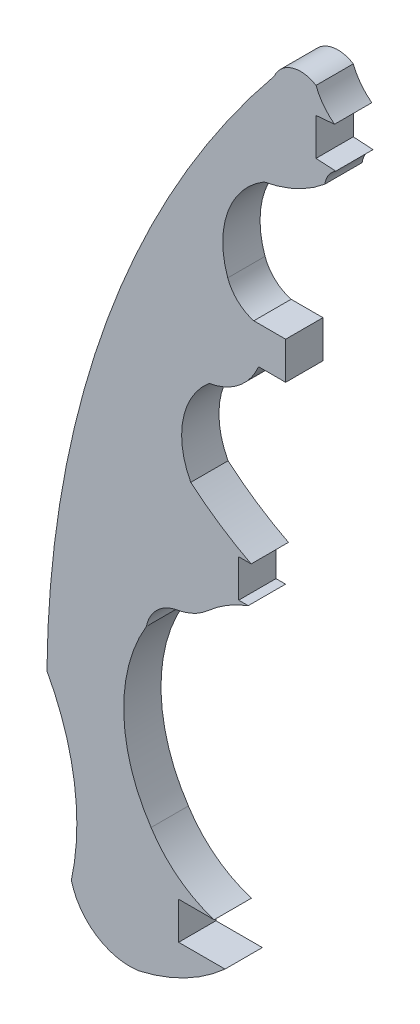
ISO-10303-21;
HEADER;
FILE_DESCRIPTION(('STEP AP214'),'2;1');
FILE_NAME('part.step','',(''),(''),'','','');
FILE_SCHEMA(('AUTOMOTIVE_DESIGN { 1 0 10303 214 1 1 1 1 }'));
ENDSEC;
DATA;
#1=APPLICATION_CONTEXT('core data for automotive mechanical design processes');
#2=APPLICATION_PROTOCOL_DEFINITION('international standard','automotive_design',2000,#1);
#3=PRODUCT_CONTEXT('',#1,'mechanical');
#4=PRODUCT('Part','Part','',(#3));
#5=PRODUCT_RELATED_PRODUCT_CATEGORY('part','',(#4));
#6=PRODUCT_DEFINITION_FORMATION('','',#4);
#7=PRODUCT_DEFINITION_CONTEXT('part definition',#1,'design');
#8=PRODUCT_DEFINITION('design','',#6,#7);
#9=PRODUCT_DEFINITION_SHAPE('','',#8);
#10=(LENGTH_UNIT() NAMED_UNIT(*) SI_UNIT(.MILLI.,.METRE.));
#11=(NAMED_UNIT(*) PLANE_ANGLE_UNIT() SI_UNIT($,.RADIAN.));
#12=(NAMED_UNIT(*) SI_UNIT($,.STERADIAN.) SOLID_ANGLE_UNIT());
#13=UNCERTAINTY_MEASURE_WITH_UNIT(LENGTH_MEASURE(1.E-05),#10,'distance_accuracy_value','');
#14=(GEOMETRIC_REPRESENTATION_CONTEXT(3) GLOBAL_UNCERTAINTY_ASSIGNED_CONTEXT((#13)) GLOBAL_UNIT_ASSIGNED_CONTEXT((#10,
#11,#12)) REPRESENTATION_CONTEXT('',''));
#15=CARTESIAN_POINT('',(0.,0.,0.));
#16=DIRECTION('',(0.,0.,1.));
#17=DIRECTION('',(1.,0.,0.));
#18=AXIS2_PLACEMENT_3D('',#15,#16,#17);
#19=CARTESIAN_POINT('',(0.,13.3480948875047,1.524));
#20=DIRECTION('',(0.,1.,0.));
#21=DIRECTION('',(0.,0.,1.));
#22=AXIS2_PLACEMENT_3D('',#19,#20,#21);
#23=PLANE('',#22);
#24=DIRECTION('',(1.,0.,0.));
#25=VECTOR('',#24,1.);
#26=CARTESIAN_POINT('',(0.,13.3480948875047,0.));
#27=LINE('',#26,#25);
#28=CARTESIAN_POINT('',(-108.369232510626,13.3480948875047,0.));
#29=VERTEX_POINT('',#28);
#30=CARTESIAN_POINT('',(-107.861232510626,13.3480948875047,0.));
#31=VERTEX_POINT('',#30);
#32=EDGE_CURVE('E262',#29,#31,#27,.T.);
#33=ORIENTED_EDGE('',*,*,#32,.T.);
#34=DIRECTION('',(0.,0.,-1.));
#35=VECTOR('',#34,1.);
#36=CARTESIAN_POINT('',(-107.861232510626,13.3480948875047,1.524));
#37=LINE('',#36,#35);
#38=CARTESIAN_POINT('',(-107.861232510626,13.3480948875047,1.524));
#39=VERTEX_POINT('',#38);
#40=EDGE_CURVE('E11',#39,#31,#37,.T.);
#41=ORIENTED_EDGE('',*,*,#40,.F.);
#42=DIRECTION('',(1.,0.,0.));
#43=VECTOR('',#42,1.);
#44=CARTESIAN_POINT('',(0.,13.3480948875047,1.524));
#45=LINE('',#44,#43);
#46=CARTESIAN_POINT('',(-108.369232510626,13.3480948875047,1.524));
#47=VERTEX_POINT('',#46);
#48=EDGE_CURVE('E345',#47,#39,#45,.T.);
#49=ORIENTED_EDGE('',*,*,#48,.F.);
#50=DIRECTION('',(0.,0.,-1.));
#51=VECTOR('',#50,1.);
#52=CARTESIAN_POINT('',(-108.369232510626,13.3480948875047,1.524));
#53=LINE('',#52,#51);
#54=EDGE_CURVE('E49',#47,#29,#53,.T.);
#55=ORIENTED_EDGE('',*,*,#54,.T.);
#56=EDGE_LOOP('',(#33,#41,#49,#55));
#57=FACE_BOUND('',#56,.T.);
#58=ADVANCED_FACE('F33',(#57),#23,.F.);
#59=CARTESIAN_POINT('',(-101.918086266978,24.886807908126,1.524));
#60=DIRECTION('',(0.,0.,-1.));
#61=DIRECTION('',(-1.,0.,0.));
#62=AXIS2_PLACEMENT_3D('',#59,#60,#61);
#63=CYLINDRICAL_SURFACE('',#62,12.9793253077979);
#64=CARTESIAN_POINT('',(-101.918086266978,24.886807908126,0.));
#65=DIRECTION('',(0.,0.,1.));
#66=DIRECTION('',(1.,0.,0.));
#67=AXIS2_PLACEMENT_3D('',#64,#65,#66);
#68=CIRCLE('',#67,12.9793253077979);
#69=CARTESIAN_POINT('',(-110.328866366672,15.0013810807081,0.));
#70=VERTEX_POINT('',#69);
#71=EDGE_CURVE('E264',#31,#70,#68,.F.);
#72=ORIENTED_EDGE('',*,*,#71,.T.);
#73=DIRECTION('',(0.,0.,-1.));
#74=VECTOR('',#73,1.);
#75=CARTESIAN_POINT('',(-110.328866366672,15.0013810807081,1.524));
#76=LINE('',#75,#74);
#77=CARTESIAN_POINT('',(-110.328866366672,15.0013810807081,1.524));
#78=VERTEX_POINT('',#77);
#79=EDGE_CURVE('E41',#78,#70,#76,.T.);
#80=ORIENTED_EDGE('',*,*,#79,.F.);
#81=CARTESIAN_POINT('',(-101.918086266978,24.886807908126,1.524));
#82=DIRECTION('',(0.,0.,1.));
#83=DIRECTION('',(1.,0.,0.));
#84=AXIS2_PLACEMENT_3D('',#81,#82,#83);
#85=CIRCLE('',#84,12.9793253077979);
#86=EDGE_CURVE('E153',#39,#78,#85,.F.);
#87=ORIENTED_EDGE('',*,*,#86,.F.);
#88=ORIENTED_EDGE('',*,*,#40,.T.);
#89=EDGE_LOOP('',(#72,#80,#87,#88));
#90=FACE_BOUND('',#89,.T.);
#91=ADVANCED_FACE('F405',(#90),#63,.F.);
#92=CARTESIAN_POINT('',(-107.580688720072,16.4812326560787,1.524));
#93=DIRECTION('',(0.,0.,-1.));
#94=DIRECTION('',(-1.,0.,0.));
#95=AXIS2_PLACEMENT_3D('',#92,#93,#94);
#96=CYLINDRICAL_SURFACE('',#95,3.12128836578655);
#97=CARTESIAN_POINT('',(-107.580688720072,16.4812326560787,0.));
#98=DIRECTION('',(0.,0.,1.));
#99=DIRECTION('',(1.,0.,0.));
#100=AXIS2_PLACEMENT_3D('',#97,#98,#99);
#101=CIRCLE('',#100,3.12128836578655);
#102=CARTESIAN_POINT('',(-109.57918557092,18.878825490475,0.));
#103=VERTEX_POINT('',#102);
#104=EDGE_CURVE('E267',#103,#70,#101,.T.);
#105=ORIENTED_EDGE('',*,*,#104,.F.);
#106=DIRECTION('',(0.,0.,-1.));
#107=VECTOR('',#106,1.);
#108=CARTESIAN_POINT('',(-109.57918557092,18.878825490475,1.524));
#109=LINE('',#108,#107);
#110=CARTESIAN_POINT('',(-109.57918557092,18.878825490475,1.524));
#111=VERTEX_POINT('',#110);
#112=EDGE_CURVE('E398',#111,#103,#109,.T.);
#113=ORIENTED_EDGE('',*,*,#112,.F.);
#114=CARTESIAN_POINT('',(-107.580688720072,16.4812326560787,1.524));
#115=DIRECTION('',(0.,0.,1.));
#116=DIRECTION('',(1.,0.,0.));
#117=AXIS2_PLACEMENT_3D('',#114,#115,#116);
#118=CIRCLE('',#117,3.12128836578655);
#119=EDGE_CURVE('E404',#111,#78,#118,.T.);
#120=ORIENTED_EDGE('',*,*,#119,.T.);
#121=ORIENTED_EDGE('',*,*,#79,.T.);
#122=EDGE_LOOP('',(#105,#113,#120,#121));
#123=FACE_BOUND('',#122,.T.);
#124=ADVANCED_FACE('F402',(#123),#96,.F.);
#125=CARTESIAN_POINT('',(-110.027978736607,21.5229388257653,1.524));
#126=DIRECTION('',(0.,0.,-1.));
#127=DIRECTION('',(-1.,0.,0.));
#128=AXIS2_PLACEMENT_3D('',#125,#126,#127);
#129=CYLINDRICAL_SURFACE('',#128,2.68193039347167);
#130=CARTESIAN_POINT('',(-110.027978736607,21.5229388257653,0.));
#131=DIRECTION('',(0.,0.,1.));
#132=DIRECTION('',(1.,0.,0.));
#133=AXIS2_PLACEMENT_3D('',#130,#131,#132);
#134=CIRCLE('',#133,2.68193039347167);
#135=CARTESIAN_POINT('',(-107.557691457711,20.4787015945033,0.));
#136=VERTEX_POINT('',#135);
#137=EDGE_CURVE('E270',#136,#103,#134,.F.);
#138=ORIENTED_EDGE('',*,*,#137,.F.);
#139=DIRECTION('',(0.,0.,-1.));
#140=VECTOR('',#139,1.);
#141=CARTESIAN_POINT('',(-107.557691457711,20.4787015945033,1.524));
#142=LINE('',#141,#140);
#143=CARTESIAN_POINT('',(-107.557691457711,20.4787015945033,1.524));
#144=VERTEX_POINT('',#143);
#145=EDGE_CURVE('E396',#144,#136,#142,.T.);
#146=ORIENTED_EDGE('',*,*,#145,.F.);
#147=CARTESIAN_POINT('',(-110.027978736607,21.5229388257653,1.524));
#148=DIRECTION('',(0.,0.,1.));
#149=DIRECTION('',(1.,0.,0.));
#150=AXIS2_PLACEMENT_3D('',#147,#148,#149);
#151=CIRCLE('',#150,2.68193039347167);
#152=EDGE_CURVE('E415',#144,#111,#151,.F.);
#153=ORIENTED_EDGE('',*,*,#152,.T.);
#154=ORIENTED_EDGE('',*,*,#112,.T.);
#155=EDGE_LOOP('',(#138,#146,#153,#154));
#156=FACE_BOUND('',#155,.T.);
#157=ADVANCED_FACE('F412',(#156),#129,.T.);
#158=CARTESIAN_POINT('',(0.,20.4787015945033,1.524));
#159=DIRECTION('',(0.,-1.,0.));
#160=DIRECTION('',(0.,0.,-1.));
#161=AXIS2_PLACEMENT_3D('',#158,#159,#160);
#162=PLANE('',#161);
#163=DIRECTION('',(-1.,0.,0.));
#164=VECTOR('',#163,1.);
#165=CARTESIAN_POINT('',(0.,20.4787015945033,0.));
#166=LINE('',#165,#164);
#167=CARTESIAN_POINT('',(-106.451038150922,20.4787015945033,0.));
#168=VERTEX_POINT('',#167);
#169=EDGE_CURVE('E273',#168,#136,#166,.T.);
#170=ORIENTED_EDGE('',*,*,#169,.F.);
#171=DIRECTION('',(0.,0.,-1.));
#172=VECTOR('',#171,1.);
#173=CARTESIAN_POINT('',(-106.451038150922,20.4787015945033,1.524));
#174=LINE('',#173,#172);
#175=CARTESIAN_POINT('',(-106.451038150922,20.4787015945033,1.524));
#176=VERTEX_POINT('',#175);
#177=EDGE_CURVE('E394',#176,#168,#174,.T.);
#178=ORIENTED_EDGE('',*,*,#177,.F.);
#179=DIRECTION('',(-1.,0.,0.));
#180=VECTOR('',#179,1.);
#181=CARTESIAN_POINT('',(0.,20.4787015945033,1.524));
#182=LINE('',#181,#180);
#183=EDGE_CURVE('E419',#176,#144,#182,.T.);
#184=ORIENTED_EDGE('',*,*,#183,.T.);
#185=ORIENTED_EDGE('',*,*,#145,.T.);
#186=EDGE_LOOP('',(#170,#178,#184,#185));
#187=FACE_BOUND('',#186,.T.);
#188=ADVANCED_FACE('F507',(#187),#162,.T.);
#189=CARTESIAN_POINT('',(-106.451038150922,0.,1.524));
#190=DIRECTION('',(1.,0.,0.));
#191=DIRECTION('',(0.,0.,-1.));
#192=AXIS2_PLACEMENT_3D('',#189,#190,#191);
#193=PLANE('',#192);
#194=DIRECTION('',(0.,-1.,0.));
#195=VECTOR('',#194,1.);
#196=CARTESIAN_POINT('',(-106.451038150922,0.,0.));
#197=LINE('',#196,#195);
#198=CARTESIAN_POINT('',(-106.451038150922,22.0063903598248,0.));
#199=VERTEX_POINT('',#198);
#200=EDGE_CURVE('E276',#199,#168,#197,.T.);
#201=ORIENTED_EDGE('',*,*,#200,.F.);
#202=DIRECTION('',(0.,0.,-1.));
#203=VECTOR('',#202,1.);
#204=CARTESIAN_POINT('',(-106.451038150922,22.0063903598248,1.524));
#205=LINE('',#204,#203);
#206=CARTESIAN_POINT('',(-106.451038150922,22.0063903598248,1.524));
#207=VERTEX_POINT('',#206);
#208=EDGE_CURVE('E392',#207,#199,#205,.T.);
#209=ORIENTED_EDGE('',*,*,#208,.F.);
#210=DIRECTION('',(0.,-1.,0.));
#211=VECTOR('',#210,1.);
#212=CARTESIAN_POINT('',(-106.451038150922,0.,1.524));
#213=LINE('',#212,#211);
#214=EDGE_CURVE('E425',#207,#176,#213,.T.);
#215=ORIENTED_EDGE('',*,*,#214,.T.);
#216=ORIENTED_EDGE('',*,*,#177,.T.);
#217=EDGE_LOOP('',(#201,#209,#215,#216));
#218=FACE_BOUND('',#217,.T.);
#219=ADVANCED_FACE('F510',(#218),#193,.T.);
#220=CARTESIAN_POINT('',(0.,22.0063903598248,1.524));
#221=DIRECTION('',(0.,-1.,0.));
#222=DIRECTION('',(0.,0.,-1.));
#223=AXIS2_PLACEMENT_3D('',#220,#221,#222);
#224=PLANE('',#223);
#225=DIRECTION('',(-1.,0.,0.));
#226=VECTOR('',#225,1.);
#227=CARTESIAN_POINT('',(0.,22.0063903598248,0.));
#228=LINE('',#227,#226);
#229=CARTESIAN_POINT('',(-107.752531071807,22.0063903598248,0.));
#230=VERTEX_POINT('',#229);
#231=EDGE_CURVE('E279',#199,#230,#228,.T.);
#232=ORIENTED_EDGE('',*,*,#231,.T.);
#233=DIRECTION('',(0.,0.,-1.));
#234=VECTOR('',#233,1.);
#235=CARTESIAN_POINT('',(-107.752531071807,22.0063903598248,1.524));
#236=LINE('',#235,#234);
#237=CARTESIAN_POINT('',(-107.752531071807,22.0063903598248,1.524));
#238=VERTEX_POINT('',#237);
#239=EDGE_CURVE('E389',#238,#230,#236,.T.);
#240=ORIENTED_EDGE('',*,*,#239,.F.);
#241=DIRECTION('',(-1.,0.,0.));
#242=VECTOR('',#241,1.);
#243=CARTESIAN_POINT('',(0.,22.0063903598248,1.524));
#244=LINE('',#243,#242);
#245=EDGE_CURVE('E428',#207,#238,#244,.T.);
#246=ORIENTED_EDGE('',*,*,#245,.F.);
#247=ORIENTED_EDGE('',*,*,#208,.T.);
#248=EDGE_LOOP('',(#232,#240,#246,#247));
#249=FACE_BOUND('',#248,.T.);
#250=ADVANCED_FACE('F514',(#249),#224,.F.);
#251=CARTESIAN_POINT('',(-107.333912624667,23.5262694653189,1.524));
#252=DIRECTION('',(0.,0.,-1.));
#253=DIRECTION('',(-1.,0.,0.));
#254=AXIS2_PLACEMENT_3D('',#251,#252,#253);
#255=CYLINDRICAL_SURFACE('',#254,1.57647515032854);
#256=CARTESIAN_POINT('',(-107.333912624667,23.5262694653189,0.));
#257=DIRECTION('',(0.,0.,1.));
#258=DIRECTION('',(1.,0.,0.));
#259=AXIS2_PLACEMENT_3D('',#256,#257,#258);
#260=CIRCLE('',#259,1.57647515032854);
#261=CARTESIAN_POINT('',(-108.817338403116,22.9926761188112,0.));
#262=VERTEX_POINT('',#261);
#263=EDGE_CURVE('E281',#230,#262,#260,.F.);
#264=ORIENTED_EDGE('',*,*,#263,.T.);
#265=DIRECTION('',(0.,0.,-1.));
#266=VECTOR('',#265,1.);
#267=CARTESIAN_POINT('',(-108.817338403116,22.9926761188112,1.524));
#268=LINE('',#267,#266);
#269=CARTESIAN_POINT('',(-108.817338403116,22.9926761188112,1.524));
#270=VERTEX_POINT('',#269);
#271=EDGE_CURVE('E386',#270,#262,#268,.T.);
#272=ORIENTED_EDGE('',*,*,#271,.F.);
#273=CARTESIAN_POINT('',(-107.333912624667,23.5262694653189,1.524));
#274=DIRECTION('',(0.,0.,1.));
#275=DIRECTION('',(1.,0.,0.));
#276=AXIS2_PLACEMENT_3D('',#273,#274,#275);
#277=CIRCLE('',#276,1.57647515032854);
#278=EDGE_CURVE('E430',#238,#270,#277,.F.);
#279=ORIENTED_EDGE('',*,*,#278,.F.);
#280=ORIENTED_EDGE('',*,*,#239,.T.);
#281=EDGE_LOOP('',(#264,#272,#279,#280));
#282=FACE_BOUND('',#281,.T.);
#283=ADVANCED_FACE('F518',(#282),#255,.F.);
#284=CARTESIAN_POINT('',(-105.565537038083,24.1623602363142,1.524));
#285=DIRECTION('',(0.,0.,-1.));
#286=DIRECTION('',(-1.,0.,0.));
#287=AXIS2_PLACEMENT_3D('',#284,#285,#286);
#288=CYLINDRICAL_SURFACE('',#287,3.45577387170587);
#289=CARTESIAN_POINT('',(-105.565537038083,24.1623602363142,0.));
#290=DIRECTION('',(0.,0.,1.));
#291=DIRECTION('',(1.,0.,0.));
#292=AXIS2_PLACEMENT_3D('',#289,#290,#291);
#293=CIRCLE('',#292,3.45577387170587);
#294=CARTESIAN_POINT('',(-107.333979521729,27.1313641491447,0.));
#295=VERTEX_POINT('',#294);
#296=EDGE_CURVE('E283',#262,#295,#293,.F.);
#297=ORIENTED_EDGE('',*,*,#296,.T.);
#298=DIRECTION('',(0.,0.,-1.));
#299=VECTOR('',#298,1.);
#300=CARTESIAN_POINT('',(-107.333979521729,27.1313641491447,1.524));
#301=LINE('',#300,#299);
#302=CARTESIAN_POINT('',(-107.333979521729,27.1313641491447,1.524));
#303=VERTEX_POINT('',#302);
#304=EDGE_CURVE('E384',#303,#295,#301,.T.);
#305=ORIENTED_EDGE('',*,*,#304,.F.);
#306=CARTESIAN_POINT('',(-105.565537038083,24.1623602363142,1.524));
#307=DIRECTION('',(0.,0.,1.));
#308=DIRECTION('',(1.,0.,0.));
#309=AXIS2_PLACEMENT_3D('',#306,#307,#308);
#310=CIRCLE('',#309,3.45577387170587);
#311=EDGE_CURVE('E432',#270,#303,#310,.F.);
#312=ORIENTED_EDGE('',*,*,#311,.F.);
#313=ORIENTED_EDGE('',*,*,#271,.T.);
#314=EDGE_LOOP('',(#297,#305,#312,#313));
#315=FACE_BOUND('',#314,.T.);
#316=ADVANCED_FACE('F522',(#315),#288,.F.);
#317=CARTESIAN_POINT('',(-108.280674511607,32.3944754546542,1.524));
#318=DIRECTION('',(0.,0.,-1.));
#319=DIRECTION('',(-1.,0.,0.));
#320=AXIS2_PLACEMENT_3D('',#317,#318,#319);
#321=CYLINDRICAL_SURFACE('',#320,5.34757627510278);
#322=CARTESIAN_POINT('',(-108.280674511607,32.3944754546542,0.));
#323=DIRECTION('',(0.,0.,1.));
#324=DIRECTION('',(1.,0.,0.));
#325=AXIS2_PLACEMENT_3D('',#322,#323,#324);
#326=CIRCLE('',#325,5.34757627510278);
#327=CARTESIAN_POINT('',(-104.849681876034,28.2926634705814,0.));
#328=VERTEX_POINT('',#327);
#329=EDGE_CURVE('E286',#328,#295,#326,.F.);
#330=ORIENTED_EDGE('',*,*,#329,.F.);
#331=DIRECTION('',(0.,0.,-1.));
#332=VECTOR('',#331,1.);
#333=CARTESIAN_POINT('',(-104.849681876034,28.2926634705814,1.524));
#334=LINE('',#333,#332);
#335=CARTESIAN_POINT('',(-104.849681876034,28.2926634705814,1.524));
#336=VERTEX_POINT('',#335);
#337=EDGE_CURVE('E382',#336,#328,#334,.T.);
#338=ORIENTED_EDGE('',*,*,#337,.F.);
#339=CARTESIAN_POINT('',(-108.280674511607,32.3944754546542,1.524));
#340=DIRECTION('',(0.,0.,1.));
#341=DIRECTION('',(1.,0.,0.));
#342=AXIS2_PLACEMENT_3D('',#339,#340,#341);
#343=CIRCLE('',#342,5.34757627510278);
#344=EDGE_CURVE('E434',#336,#303,#343,.F.);
#345=ORIENTED_EDGE('',*,*,#344,.T.);
#346=ORIENTED_EDGE('',*,*,#304,.T.);
#347=EDGE_LOOP('',(#330,#338,#345,#346));
#348=FACE_BOUND('',#347,.T.);
#349=ADVANCED_FACE('F526',(#348),#321,.T.);
#350=CARTESIAN_POINT('',(-103.869108877583,28.1418799717256,1.524));
#351=DIRECTION('',(0.,0.,-1.));
#352=DIRECTION('',(-1.,0.,0.));
#353=AXIS2_PLACEMENT_3D('',#350,#351,#352);
#354=CYLINDRICAL_SURFACE('',#353,0.992098316104333);
#355=CARTESIAN_POINT('',(-103.869108877583,28.1418799717256,0.));
#356=DIRECTION('',(0.,0.,1.));
#357=DIRECTION('',(1.,0.,0.));
#358=AXIS2_PLACEMENT_3D('',#355,#356,#357);
#359=CIRCLE('',#358,0.992098316104333);
#360=CARTESIAN_POINT('',(-104.403994807569,28.9774373370335,0.));
#361=VERTEX_POINT('',#360);
#362=EDGE_CURVE('E289',#361,#328,#359,.T.);
#363=ORIENTED_EDGE('',*,*,#362,.F.);
#364=DIRECTION('',(0.,0.,-1.));
#365=VECTOR('',#364,1.);
#366=CARTESIAN_POINT('',(-104.403994807569,28.9774373370335,1.524));
#367=LINE('',#366,#365);
#368=CARTESIAN_POINT('',(-104.403994807569,28.9774373370335,1.524));
#369=VERTEX_POINT('',#368);
#370=EDGE_CURVE('E380',#369,#361,#367,.T.);
#371=ORIENTED_EDGE('',*,*,#370,.F.);
#372=CARTESIAN_POINT('',(-103.869108877583,28.1418799717256,1.524));
#373=DIRECTION('',(0.,0.,1.));
#374=DIRECTION('',(1.,0.,0.));
#375=AXIS2_PLACEMENT_3D('',#372,#373,#374);
#376=CIRCLE('',#375,0.992098316104333);
#377=EDGE_CURVE('E437',#369,#336,#376,.T.);
#378=ORIENTED_EDGE('',*,*,#377,.T.);
#379=ORIENTED_EDGE('',*,*,#337,.T.);
#380=EDGE_LOOP('',(#363,#371,#378,#379));
#381=FACE_BOUND('',#380,.T.);
#382=ADVANCED_FACE('F530',(#381),#354,.F.);
#383=CARTESIAN_POINT('',(1.34778701210068,22.6979872481388,1.524));
#384=DIRECTION('',(0.0592747362554911,0.998241707023826,0.));
#385=DIRECTION('',(-0.998241707023826,0.0592747362554911,0.));
#386=AXIS2_PLACEMENT_3D('',#383,#384,#385);
#387=PLANE('',#386);
#388=DIRECTION('',(0.998241707023826,-0.0592747362554911,0.));
#389=VECTOR('',#388,1.);
#390=CARTESIAN_POINT('',(1.34778701210068,22.6979872481388,0.));
#391=LINE('',#390,#389);
#392=CARTESIAN_POINT('',(-105.211200263327,29.0253685045627,0.));
#393=VERTEX_POINT('',#392);
#394=EDGE_CURVE('E292',#393,#361,#391,.T.);
#395=ORIENTED_EDGE('',*,*,#394,.F.);
#396=DIRECTION('',(0.,0.,-1.));
#397=VECTOR('',#396,1.);
#398=CARTESIAN_POINT('',(-105.211200263327,29.0253685045627,1.524));
#399=LINE('',#398,#397);
#400=CARTESIAN_POINT('',(-105.211200263327,29.0253685045627,1.524));
#401=VERTEX_POINT('',#400);
#402=EDGE_CURVE('E378',#401,#393,#399,.T.);
#403=ORIENTED_EDGE('',*,*,#402,.F.);
#404=DIRECTION('',(0.998241707023826,-0.0592747362554911,0.));
#405=VECTOR('',#404,1.);
#406=CARTESIAN_POINT('',(1.34778701210068,22.6979872481388,1.524));
#407=LINE('',#406,#405);
#408=EDGE_CURVE('E440',#401,#369,#407,.T.);
#409=ORIENTED_EDGE('',*,*,#408,.T.);
#410=ORIENTED_EDGE('',*,*,#370,.T.);
#411=EDGE_LOOP('',(#395,#403,#409,#410));
#412=FACE_BOUND('',#411,.T.);
#413=ADVANCED_FACE('F534',(#412),#387,.T.);
#414=CARTESIAN_POINT('',(-105.211200263327,0.,1.524));
#415=DIRECTION('',(1.,0.,0.));
#416=DIRECTION('',(0.,0.,-1.));
#417=AXIS2_PLACEMENT_3D('',#414,#415,#416);
#418=PLANE('',#417);
#419=DIRECTION('',(0.,-1.,0.));
#420=VECTOR('',#419,1.);
#421=CARTESIAN_POINT('',(-105.211200263327,0.,0.));
#422=LINE('',#421,#420);
#423=CARTESIAN_POINT('',(-105.211200263327,30.5448254073895,0.));
#424=VERTEX_POINT('',#423);
#425=EDGE_CURVE('E295',#424,#393,#422,.T.);
#426=ORIENTED_EDGE('',*,*,#425,.F.);
#427=DIRECTION('',(0.,0.,-1.));
#428=VECTOR('',#427,1.);
#429=CARTESIAN_POINT('',(-105.211200263327,30.5448254073895,1.524));
#430=LINE('',#429,#428);
#431=CARTESIAN_POINT('',(-105.211200263327,30.5448254073895,1.524));
#432=VERTEX_POINT('',#431);
#433=EDGE_CURVE('E376',#432,#424,#430,.T.);
#434=ORIENTED_EDGE('',*,*,#433,.F.);
#435=DIRECTION('',(0.,-1.,0.));
#436=VECTOR('',#435,1.);
#437=CARTESIAN_POINT('',(-105.211200263327,0.,1.524));
#438=LINE('',#437,#436);
#439=EDGE_CURVE('E443',#432,#401,#438,.T.);
#440=ORIENTED_EDGE('',*,*,#439,.T.);
#441=ORIENTED_EDGE('',*,*,#402,.T.);
#442=EDGE_LOOP('',(#426,#434,#440,#441));
#443=FACE_BOUND('',#442,.T.);
#444=ADVANCED_FACE('F538',(#443),#418,.T.);
#445=CARTESIAN_POINT('',(-3.48086621479973,39.5078469395772,1.524));
#446=DIRECTION('',(0.0877657054415344,-0.99614114509358,0.));
#447=DIRECTION('',(0.996141145093581,0.0877657054415344,0.));
#448=AXIS2_PLACEMENT_3D('',#445,#446,#447);
#449=PLANE('',#448);
#450=DIRECTION('',(-0.996141145093581,-0.0877657054415344,0.));
#451=VECTOR('',#450,1.);
#452=CARTESIAN_POINT('',(-3.48086621479973,39.5078469395772,0.));
#453=LINE('',#452,#451);
#454=CARTESIAN_POINT('',(-104.454303839496,30.611512290981,0.));
#455=VERTEX_POINT('',#454);
#456=EDGE_CURVE('E298',#455,#424,#453,.T.);
#457=ORIENTED_EDGE('',*,*,#456,.F.);
#458=DIRECTION('',(0.,0.,-1.));
#459=VECTOR('',#458,1.);
#460=CARTESIAN_POINT('',(-104.454303839496,30.611512290981,1.524));
#461=LINE('',#460,#459);
#462=CARTESIAN_POINT('',(-104.454303839496,30.611512290981,1.524));
#463=VERTEX_POINT('',#462);
#464=EDGE_CURVE('E374',#463,#455,#461,.T.);
#465=ORIENTED_EDGE('',*,*,#464,.F.);
#466=DIRECTION('',(-0.996141145093581,-0.0877657054415344,0.));
#467=VECTOR('',#466,1.);
#468=CARTESIAN_POINT('',(-3.48086621479973,39.5078469395772,1.524));
#469=LINE('',#468,#467);
#470=EDGE_CURVE('E446',#463,#432,#469,.T.);
#471=ORIENTED_EDGE('',*,*,#470,.T.);
#472=ORIENTED_EDGE('',*,*,#433,.T.);
#473=EDGE_LOOP('',(#457,#465,#471,#472));
#474=FACE_BOUND('',#473,.T.);
#475=ADVANCED_FACE('F542',(#474),#449,.T.);
#476=CARTESIAN_POINT('',(-103.059366981798,32.4561400903915,1.524));
#477=DIRECTION('',(0.,0.,-1.));
#478=DIRECTION('',(-1.,0.,0.));
#479=AXIS2_PLACEMENT_3D('',#476,#477,#478);
#480=CYLINDRICAL_SURFACE('',#479,2.31268254529747);
#481=CARTESIAN_POINT('',(-103.059366981798,32.4561400903915,0.));
#482=DIRECTION('',(0.,0.,1.));
#483=DIRECTION('',(1.,0.,0.));
#484=AXIS2_PLACEMENT_3D('',#481,#482,#483);
#485=CIRCLE('',#484,2.31268254529747);
#486=CARTESIAN_POINT('',(-105.211200263327,31.6087239683895,0.));
#487=VERTEX_POINT('',#486);
#488=EDGE_CURVE('E301',#487,#455,#485,.T.);
#489=ORIENTED_EDGE('',*,*,#488,.F.);
#490=DIRECTION('',(0.,0.,-1.));
#491=VECTOR('',#490,1.);
#492=CARTESIAN_POINT('',(-105.211200263327,31.6087239683895,1.524));
#493=LINE('',#492,#491);
#494=CARTESIAN_POINT('',(-105.211200263327,31.6087239683895,1.524));
#495=VERTEX_POINT('',#494);
#496=EDGE_CURVE('E372',#495,#487,#493,.T.);
#497=ORIENTED_EDGE('',*,*,#496,.F.);
#498=CARTESIAN_POINT('',(-103.059366981798,32.4561400903915,1.524));
#499=DIRECTION('',(0.,0.,1.));
#500=DIRECTION('',(1.,0.,0.));
#501=AXIS2_PLACEMENT_3D('',#498,#499,#500);
#502=CIRCLE('',#501,2.31268254529747);
#503=EDGE_CURVE('E449',#495,#463,#502,.T.);
#504=ORIENTED_EDGE('',*,*,#503,.T.);
#505=ORIENTED_EDGE('',*,*,#464,.T.);
#506=EDGE_LOOP('',(#489,#497,#504,#505));
#507=FACE_BOUND('',#506,.T.);
#508=ADVANCED_FACE('F546',(#507),#480,.F.);
#509=CARTESIAN_POINT('',(-105.837320906782,30.611512290981,1.524));
#510=DIRECTION('',(0.,0.,-1.));
#511=DIRECTION('',(-1.,0.,0.));
#512=AXIS2_PLACEMENT_3D('',#509,#510,#511);
#513=CYLINDRICAL_SURFACE('',#512,1.17747959206144);
#514=CARTESIAN_POINT('',(-105.837320906782,30.611512290981,0.));
#515=DIRECTION('',(0.,0.,1.));
#516=DIRECTION('',(1.,0.,0.));
#517=AXIS2_PLACEMENT_3D('',#514,#515,#516);
#518=CIRCLE('',#517,1.17747959206144);
#519=CARTESIAN_POINT('',(-106.916865485232,31.0816630039028,0.));
#520=VERTEX_POINT('',#519);
#521=EDGE_CURVE('E304',#520,#487,#518,.F.);
#522=ORIENTED_EDGE('',*,*,#521,.F.);
#523=DIRECTION('',(0.,0.,-1.));
#524=VECTOR('',#523,1.);
#525=CARTESIAN_POINT('',(-106.916865485232,31.0816630039028,1.524));
#526=LINE('',#525,#524);
#527=CARTESIAN_POINT('',(-106.916865485232,31.0816630039028,1.524));
#528=VERTEX_POINT('',#527);
#529=EDGE_CURVE('E370',#528,#520,#526,.T.);
#530=ORIENTED_EDGE('',*,*,#529,.F.);
#531=CARTESIAN_POINT('',(-105.837320906782,30.611512290981,1.524));
#532=DIRECTION('',(0.,0.,1.));
#533=DIRECTION('',(1.,0.,0.));
#534=AXIS2_PLACEMENT_3D('',#531,#532,#533);
#535=CIRCLE('',#534,1.17747959206144);
#536=EDGE_CURVE('E452',#528,#495,#535,.F.);
#537=ORIENTED_EDGE('',*,*,#536,.T.);
#538=ORIENTED_EDGE('',*,*,#496,.T.);
#539=EDGE_LOOP('',(#522,#530,#537,#538));
#540=FACE_BOUND('',#539,.T.);
#541=ADVANCED_FACE('F550',(#540),#513,.T.);
#542=CARTESIAN_POINT('',(-74.9979352647448,5.01694432604405,1.524));
#543=DIRECTION('',(0.,0.,-1.));
#544=DIRECTION('',(-1.,0.,0.));
#545=AXIS2_PLACEMENT_3D('',#542,#543,#544);
#546=CYLINDRICAL_SURFACE('',#545,41.2090726197065);
#547=CARTESIAN_POINT('',(-74.9979352647448,5.01694432604405,0.));
#548=DIRECTION('',(0.,0.,1.));
#549=DIRECTION('',(1.,0.,0.));
#550=AXIS2_PLACEMENT_3D('',#547,#548,#549);
#551=CIRCLE('',#550,41.2090726197065);
#552=CARTESIAN_POINT('',(-116.205341732837,5.38750923225173,0.));
#553=VERTEX_POINT('',#552);
#554=EDGE_CURVE('E307',#553,#520,#551,.F.);
#555=ORIENTED_EDGE('',*,*,#554,.F.);
#556=DIRECTION('',(0.,0.,-1.));
#557=VECTOR('',#556,1.);
#558=CARTESIAN_POINT('',(-116.205341732837,5.38750923225173,1.524));
#559=LINE('',#558,#557);
#560=CARTESIAN_POINT('',(-116.205341732837,5.38750923225173,1.524));
#561=VERTEX_POINT('',#560);
#562=EDGE_CURVE('E368',#561,#553,#559,.T.);
#563=ORIENTED_EDGE('',*,*,#562,.F.);
#564=CARTESIAN_POINT('',(-74.9979352647448,5.01694432604405,1.524));
#565=DIRECTION('',(0.,0.,1.));
#566=DIRECTION('',(1.,0.,0.));
#567=AXIS2_PLACEMENT_3D('',#564,#565,#566);
#568=CIRCLE('',#567,41.2090726197065);
#569=EDGE_CURVE('E455',#561,#528,#568,.F.);
#570=ORIENTED_EDGE('',*,*,#569,.T.);
#571=ORIENTED_EDGE('',*,*,#529,.T.);
#572=EDGE_LOOP('',(#555,#563,#570,#571));
#573=FACE_BOUND('',#572,.T.);
#574=ADVANCED_FACE('F554',(#573),#546,.T.);
#575=CARTESIAN_POINT('',(-125.036003899701,0.58522331589663,1.524));
#576=DIRECTION('',(0.,0.,-1.));
#577=DIRECTION('',(-1.,0.,0.));
#578=AXIS2_PLACEMENT_3D('',#575,#576,#577);
#579=CYLINDRICAL_SURFACE('',#578,10.0519920576828);
#580=CARTESIAN_POINT('',(-125.036003899701,0.58522331589663,0.));
#581=DIRECTION('',(0.,0.,1.));
#582=DIRECTION('',(1.,0.,0.));
#583=AXIS2_PLACEMENT_3D('',#580,#581,#582);
#584=CIRCLE('',#583,10.0519920576828);
#585=CARTESIAN_POINT('',(-115.20779341501,-1.524,0.));
#586=VERTEX_POINT('',#585);
#587=EDGE_CURVE('E310',#586,#553,#584,.T.);
#588=ORIENTED_EDGE('',*,*,#587,.F.);
#589=DIRECTION('',(0.,0.,-1.));
#590=VECTOR('',#589,1.);
#591=CARTESIAN_POINT('',(-115.20779341501,-1.524,1.524));
#592=LINE('',#591,#590);
#593=CARTESIAN_POINT('',(-115.20779341501,-1.524,1.524));
#594=VERTEX_POINT('',#593);
#595=EDGE_CURVE('E366',#594,#586,#592,.T.);
#596=ORIENTED_EDGE('',*,*,#595,.F.);
#597=CARTESIAN_POINT('',(-125.036003899701,0.58522331589663,1.524));
#598=DIRECTION('',(0.,0.,1.));
#599=DIRECTION('',(1.,0.,0.));
#600=AXIS2_PLACEMENT_3D('',#597,#598,#599);
#601=CIRCLE('',#600,10.0519920576828);
#602=EDGE_CURVE('E458',#594,#561,#601,.T.);
#603=ORIENTED_EDGE('',*,*,#602,.T.);
#604=ORIENTED_EDGE('',*,*,#562,.T.);
#605=EDGE_LOOP('',(#588,#596,#603,#604));
#606=FACE_BOUND('',#605,.T.);
#607=ADVANCED_FACE('F558',(#606),#579,.F.);
#608=CARTESIAN_POINT('',(-112.821376912459,-0.911900097014079,1.524));
#609=DIRECTION('',(0.,0.,-1.));
#610=DIRECTION('',(-1.,0.,0.));
#611=AXIS2_PLACEMENT_3D('',#608,#609,#610);
#612=CYLINDRICAL_SURFACE('',#611,2.46366597063845);
#613=CARTESIAN_POINT('',(-112.821376912459,-0.911900097014079,0.));
#614=DIRECTION('',(0.,0.,1.));
#615=DIRECTION('',(1.,0.,0.));
#616=AXIS2_PLACEMENT_3D('',#613,#614,#615);
#617=CIRCLE('',#616,2.46366597063845);
#618=CARTESIAN_POINT('',(-112.442883949143,-3.34631852686584,0.));
#619=VERTEX_POINT('',#618);
#620=EDGE_CURVE('E313',#619,#586,#617,.F.);
#621=ORIENTED_EDGE('',*,*,#620,.F.);
#622=DIRECTION('',(0.,0.,-1.));
#623=VECTOR('',#622,1.);
#624=CARTESIAN_POINT('',(-112.442883949143,-3.34631852686584,1.524));
#625=LINE('',#624,#623);
#626=CARTESIAN_POINT('',(-112.442883949143,-3.34631852686584,1.524));
#627=VERTEX_POINT('',#626);
#628=EDGE_CURVE('E364',#627,#619,#625,.T.);
#629=ORIENTED_EDGE('',*,*,#628,.F.);
#630=CARTESIAN_POINT('',(-112.821376912459,-0.911900097014079,1.524));
#631=DIRECTION('',(0.,0.,1.));
#632=DIRECTION('',(1.,0.,0.));
#633=AXIS2_PLACEMENT_3D('',#630,#631,#632);
#634=CIRCLE('',#633,2.46366597063845);
#635=EDGE_CURVE('E461',#627,#594,#634,.F.);
#636=ORIENTED_EDGE('',*,*,#635,.T.);
#637=ORIENTED_EDGE('',*,*,#595,.T.);
#638=EDGE_LOOP('',(#621,#629,#636,#637));
#639=FACE_BOUND('',#638,.T.);
#640=ADVANCED_FACE('F562',(#639),#612,.T.);
#641=CARTESIAN_POINT('',(-114.18936905214,4.32394775964582,1.524));
#642=DIRECTION('',(0.,0.,-1.));
#643=DIRECTION('',(-1.,0.,0.));
#644=AXIS2_PLACEMENT_3D('',#641,#642,#643);
#645=CYLINDRICAL_SURFACE('',#644,7.86658726011411);
#646=CARTESIAN_POINT('',(-114.18936905214,4.32394775964582,0.));
#647=DIRECTION('',(0.,0.,1.));
#648=DIRECTION('',(1.,0.,0.));
#649=AXIS2_PLACEMENT_3D('',#646,#647,#648);
#650=CIRCLE('',#649,7.86658726011411);
#651=CARTESIAN_POINT('',(-108.927743626339,-1.524,0.));
#652=VERTEX_POINT('',#651);
#653=EDGE_CURVE('E316',#652,#619,#650,.F.);
#654=ORIENTED_EDGE('',*,*,#653,.F.);
#655=DIRECTION('',(0.,0.,-1.));
#656=VECTOR('',#655,1.);
#657=CARTESIAN_POINT('',(-108.927743626339,-1.524,1.524));
#658=LINE('',#657,#656);
#659=CARTESIAN_POINT('',(-108.927743626339,-1.524,1.524));
#660=VERTEX_POINT('',#659);
#661=EDGE_CURVE('E362',#660,#652,#658,.T.);
#662=ORIENTED_EDGE('',*,*,#661,.F.);
#663=CARTESIAN_POINT('',(-114.18936905214,4.32394775964582,1.524));
#664=DIRECTION('',(0.,0.,1.));
#665=DIRECTION('',(1.,0.,0.));
#666=AXIS2_PLACEMENT_3D('',#663,#664,#665);
#667=CIRCLE('',#666,7.86658726011411);
#668=EDGE_CURVE('E464',#660,#627,#667,.F.);
#669=ORIENTED_EDGE('',*,*,#668,.T.);
#670=ORIENTED_EDGE('',*,*,#628,.T.);
#671=EDGE_LOOP('',(#654,#662,#669,#670));
#672=FACE_BOUND('',#671,.T.);
#673=ADVANCED_FACE('F566',(#672),#645,.T.);
#674=CARTESIAN_POINT('',(0.,-1.524,1.524));
#675=DIRECTION('',(0.,1.,0.));
#676=DIRECTION('',(0.,0.,1.));
#677=AXIS2_PLACEMENT_3D('',#674,#675,#676);
#678=PLANE('',#677);
#679=DIRECTION('',(1.,0.,0.));
#680=VECTOR('',#679,1.);
#681=CARTESIAN_POINT('',(0.,-1.524,0.));
#682=LINE('',#681,#680);
#683=CARTESIAN_POINT('',(-110.824360774291,-1.524,0.));
#684=VERTEX_POINT('',#683);
#685=EDGE_CURVE('E319',#684,#652,#682,.T.);
#686=ORIENTED_EDGE('',*,*,#685,.F.);
#687=DIRECTION('',(0.,0.,-1.));
#688=VECTOR('',#687,1.);
#689=CARTESIAN_POINT('',(-110.824360774291,-1.524,1.524));
#690=LINE('',#689,#688);
#691=CARTESIAN_POINT('',(-110.824360774291,-1.524,1.524));
#692=VERTEX_POINT('',#691);
#693=EDGE_CURVE('E360',#692,#684,#690,.T.);
#694=ORIENTED_EDGE('',*,*,#693,.F.);
#695=DIRECTION('',(1.,0.,0.));
#696=VECTOR('',#695,1.);
#697=CARTESIAN_POINT('',(0.,-1.524,1.524));
#698=LINE('',#697,#696);
#699=EDGE_CURVE('E467',#692,#660,#698,.T.);
#700=ORIENTED_EDGE('',*,*,#699,.T.);
#701=ORIENTED_EDGE('',*,*,#661,.T.);
#702=EDGE_LOOP('',(#686,#694,#700,#701));
#703=FACE_BOUND('',#702,.T.);
#704=ADVANCED_FACE('F570',(#703),#678,.T.);
#705=CARTESIAN_POINT('',(-110.824360774291,0.,1.524));
#706=DIRECTION('',(1.,0.,0.));
#707=DIRECTION('',(0.,0.,-1.));
#708=AXIS2_PLACEMENT_3D('',#705,#706,#707);
#709=PLANE('',#708);
#710=DIRECTION('',(0.,-1.,0.));
#711=VECTOR('',#710,1.);
#712=CARTESIAN_POINT('',(-110.824360774291,0.,0.));
#713=LINE('',#712,#711);
#714=CARTESIAN_POINT('',(-110.824360774291,0.,0.));
#715=VERTEX_POINT('',#714);
#716=EDGE_CURVE('E322',#715,#684,#713,.T.);
#717=ORIENTED_EDGE('',*,*,#716,.F.);
#718=DIRECTION('',(0.,0.,-1.));
#719=VECTOR('',#718,1.);
#720=CARTESIAN_POINT('',(-110.824360774291,0.,1.524));
#721=LINE('',#720,#719);
#722=CARTESIAN_POINT('',(-110.824360774291,0.,1.524));
#723=VERTEX_POINT('',#722);
#724=EDGE_CURVE('E358',#723,#715,#721,.T.);
#725=ORIENTED_EDGE('',*,*,#724,.F.);
#726=DIRECTION('',(0.,-1.,0.));
#727=VECTOR('',#726,1.);
#728=CARTESIAN_POINT('',(-110.824360774291,0.,1.524));
#729=LINE('',#728,#727);
#730=EDGE_CURVE('E470',#723,#692,#729,.T.);
#731=ORIENTED_EDGE('',*,*,#730,.T.);
#732=ORIENTED_EDGE('',*,*,#693,.T.);
#733=EDGE_LOOP('',(#717,#725,#731,#732));
#734=FACE_BOUND('',#733,.T.);
#735=ADVANCED_FACE('F574',(#734),#709,.T.);
#736=CARTESIAN_POINT('',(0.,-1.1494748147781E-13,1.524));
#737=DIRECTION('',(0.,1.,0.));
#738=DIRECTION('',(-1.,0.,0.));
#739=AXIS2_PLACEMENT_3D('',#736,#737,#738);
#740=PLANE('',#739);
#741=DIRECTION('',(1.,0.,0.));
#742=VECTOR('',#741,1.);
#743=CARTESIAN_POINT('',(0.,-1.1494748147781E-13,0.));
#744=LINE('',#743,#742);
#745=CARTESIAN_POINT('',(-109.373389254102,0.,0.));
#746=VERTEX_POINT('',#745);
#747=EDGE_CURVE('E325',#715,#746,#744,.T.);
#748=ORIENTED_EDGE('',*,*,#747,.T.);
#749=DIRECTION('',(0.,0.,-1.));
#750=VECTOR('',#749,1.);
#751=CARTESIAN_POINT('',(-109.373389254102,0.,1.524));
#752=LINE('',#751,#750);
#753=CARTESIAN_POINT('',(-109.373389254102,0.,1.524));
#754=VERTEX_POINT('',#753);
#755=EDGE_CURVE('E355',#754,#746,#752,.T.);
#756=ORIENTED_EDGE('',*,*,#755,.F.);
#757=DIRECTION('',(1.,0.,0.));
#758=VECTOR('',#757,1.);
#759=CARTESIAN_POINT('',(0.,-1.1494748147781E-13,1.524));
#760=LINE('',#759,#758);
#761=EDGE_CURVE('E473',#723,#754,#760,.T.);
#762=ORIENTED_EDGE('',*,*,#761,.F.);
#763=ORIENTED_EDGE('',*,*,#724,.T.);
#764=EDGE_LOOP('',(#748,#756,#762,#763));
#765=FACE_BOUND('',#764,.T.);
#766=ADVANCED_FACE('F578',(#765),#740,.F.);
#767=CARTESIAN_POINT('',(-107.97967598118,4.48553225992145,1.524));
#768=DIRECTION('',(0.,0.,-1.));
#769=DIRECTION('',(-1.,0.,0.));
#770=AXIS2_PLACEMENT_3D('',#767,#768,#769);
#771=CYLINDRICAL_SURFACE('',#770,4.69706678065338);
#772=CARTESIAN_POINT('',(-107.97967598118,4.48553225992145,0.));
#773=DIRECTION('',(0.,0.,1.));
#774=DIRECTION('',(1.,0.,0.));
#775=AXIS2_PLACEMENT_3D('',#772,#773,#774);
#776=CIRCLE('',#775,4.69706678065338);
#777=CARTESIAN_POINT('',(-111.950245847538,1.97614761856357,0.));
#778=VERTEX_POINT('',#777);
#779=EDGE_CURVE('E327',#746,#778,#776,.F.);
#780=ORIENTED_EDGE('',*,*,#779,.T.);
#781=DIRECTION('',(0.,0.,-1.));
#782=VECTOR('',#781,1.);
#783=CARTESIAN_POINT('',(-111.950245847538,1.97614761856357,1.524));
#784=LINE('',#783,#782);
#785=CARTESIAN_POINT('',(-111.950245847538,1.97614761856357,1.524));
#786=VERTEX_POINT('',#785);
#787=EDGE_CURVE('E353',#786,#778,#784,.T.);
#788=ORIENTED_EDGE('',*,*,#787,.F.);
#789=CARTESIAN_POINT('',(-107.97967598118,4.48553225992145,1.524));
#790=DIRECTION('',(0.,0.,1.));
#791=DIRECTION('',(1.,0.,0.));
#792=AXIS2_PLACEMENT_3D('',#789,#790,#791);
#793=CIRCLE('',#792,4.69706678065338);
#794=EDGE_CURVE('E475',#754,#786,#793,.F.);
#795=ORIENTED_EDGE('',*,*,#794,.F.);
#796=ORIENTED_EDGE('',*,*,#755,.T.);
#797=EDGE_LOOP('',(#780,#788,#795,#796));
#798=FACE_BOUND('',#797,.T.);
#799=ADVANCED_FACE('F582',(#798),#771,.F.);
#800=CARTESIAN_POINT('',(-106.520013862702,5.63759579505181,1.524));
#801=DIRECTION('',(0.,0.,-1.));
#802=DIRECTION('',(-1.,0.,0.));
#803=AXIS2_PLACEMENT_3D('',#800,#801,#802);
#804=CYLINDRICAL_SURFACE('',#803,6.54932226709318);
#805=CARTESIAN_POINT('',(-106.520013862702,5.63759579505181,0.));
#806=DIRECTION('',(0.,0.,1.));
#807=DIRECTION('',(1.,0.,0.));
#808=AXIS2_PLACEMENT_3D('',#805,#806,#807);
#809=CIRCLE('',#808,6.54932226709318);
#810=CARTESIAN_POINT('',(-112.143869500187,8.99406267660652,0.));
#811=VERTEX_POINT('',#810);
#812=EDGE_CURVE('E330',#811,#778,#809,.T.);
#813=ORIENTED_EDGE('',*,*,#812,.F.);
#814=DIRECTION('',(0.,0.,-1.));
#815=VECTOR('',#814,1.);
#816=CARTESIAN_POINT('',(-112.143869500187,8.99406267660652,1.524));
#817=LINE('',#816,#815);
#818=CARTESIAN_POINT('',(-112.143869500187,8.99406267660652,1.524));
#819=VERTEX_POINT('',#818);
#820=EDGE_CURVE('E351',#819,#811,#817,.T.);
#821=ORIENTED_EDGE('',*,*,#820,.F.);
#822=CARTESIAN_POINT('',(-106.520013862702,5.63759579505181,1.524));
#823=DIRECTION('',(0.,0.,1.));
#824=DIRECTION('',(1.,0.,0.));
#825=AXIS2_PLACEMENT_3D('',#822,#823,#824);
#826=CIRCLE('',#825,6.54932226709318);
#827=EDGE_CURVE('E477',#819,#786,#826,.T.);
#828=ORIENTED_EDGE('',*,*,#827,.T.);
#829=ORIENTED_EDGE('',*,*,#787,.T.);
#830=EDGE_LOOP('',(#813,#821,#828,#829));
#831=FACE_BOUND('',#830,.T.);
#832=ADVANCED_FACE('F586',(#831),#804,.F.);
#833=CARTESIAN_POINT('',(-110.632863237933,8.68429736091204,1.524));
#834=DIRECTION('',(0.,0.,-1.));
#835=DIRECTION('',(-1.,0.,0.));
#836=AXIS2_PLACEMENT_3D('',#833,#834,#835);
#837=CYLINDRICAL_SURFACE('',#836,1.54243135191797);
#838=CARTESIAN_POINT('',(-110.632863237933,8.68429736091204,0.));
#839=DIRECTION('',(0.,0.,1.));
#840=DIRECTION('',(1.,0.,0.));
#841=AXIS2_PLACEMENT_3D('',#838,#839,#840);
#842=CIRCLE('',#841,1.54243135191797);
#843=CARTESIAN_POINT('',(-110.890927128681,10.2049871726985,0.));
#844=VERTEX_POINT('',#843);
#845=EDGE_CURVE('E333',#844,#811,#842,.T.);
#846=ORIENTED_EDGE('',*,*,#845,.F.);
#847=DIRECTION('',(0.,0.,-1.));
#848=VECTOR('',#847,1.);
#849=CARTESIAN_POINT('',(-110.890927128681,10.2049871726985,1.524));
#850=LINE('',#849,#848);
#851=CARTESIAN_POINT('',(-110.890927128681,10.2049871726985,1.524));
#852=VERTEX_POINT('',#851);
#853=EDGE_CURVE('E349',#852,#844,#850,.T.);
#854=ORIENTED_EDGE('',*,*,#853,.F.);
#855=CARTESIAN_POINT('',(-110.632863237933,8.68429736091204,1.524));
#856=DIRECTION('',(0.,0.,1.));
#857=DIRECTION('',(1.,0.,0.));
#858=AXIS2_PLACEMENT_3D('',#855,#856,#857);
#859=CIRCLE('',#858,1.54243135191797);
#860=EDGE_CURVE('E480',#852,#819,#859,.T.);
#861=ORIENTED_EDGE('',*,*,#860,.T.);
#862=ORIENTED_EDGE('',*,*,#820,.T.);
#863=EDGE_LOOP('',(#846,#854,#861,#862));
#864=FACE_BOUND('',#863,.T.);
#865=ADVANCED_FACE('F590',(#864),#837,.F.);
#866=CARTESIAN_POINT('',(-111.315894036729,12.7091842749778,1.524));
#867=DIRECTION('',(0.,0.,-1.));
#868=DIRECTION('',(-1.,0.,0.));
#869=AXIS2_PLACEMENT_3D('',#866,#867,#868);
#870=CYLINDRICAL_SURFACE('',#869,2.54);
#871=CARTESIAN_POINT('',(-111.315894036729,12.7091842749778,0.));
#872=DIRECTION('',(0.,0.,1.));
#873=DIRECTION('',(1.,0.,0.));
#874=AXIS2_PLACEMENT_3D('',#871,#872,#873);
#875=CIRCLE('',#874,2.54);
#876=CARTESIAN_POINT('',(-109.628173594925,10.8109746684493,0.));
#877=VERTEX_POINT('',#876);
#878=EDGE_CURVE('E336',#877,#844,#875,.F.);
#879=ORIENTED_EDGE('',*,*,#878,.F.);
#880=DIRECTION('',(0.,0.,-1.));
#881=VECTOR('',#880,1.);
#882=CARTESIAN_POINT('',(-109.628173594925,10.8109746684493,1.524));
#883=LINE('',#882,#881);
#884=CARTESIAN_POINT('',(-109.628173594925,10.8109746684493,1.524));
#885=VERTEX_POINT('',#884);
#886=EDGE_CURVE('E244',#885,#877,#883,.T.);
#887=ORIENTED_EDGE('',*,*,#886,.F.);
#888=CARTESIAN_POINT('',(-111.315894036729,12.7091842749778,1.524));
#889=DIRECTION('',(0.,0.,1.));
#890=DIRECTION('',(1.,0.,0.));
#891=AXIS2_PLACEMENT_3D('',#888,#889,#890);
#892=CIRCLE('',#891,2.54);
#893=EDGE_CURVE('E254',#885,#852,#892,.F.);
#894=ORIENTED_EDGE('',*,*,#893,.T.);
#895=ORIENTED_EDGE('',*,*,#853,.T.);
#896=EDGE_LOOP('',(#879,#887,#894,#895));
#897=FACE_BOUND('',#896,.T.);
#898=ADVANCED_FACE('F484',(#897),#870,.T.);
#899=CARTESIAN_POINT('',(-106.077482899211,6.81744883237407,1.524));
#900=DIRECTION('',(0.,0.,-1.));
#901=DIRECTION('',(-1.,0.,0.));
#902=AXIS2_PLACEMENT_3D('',#899,#900,#901);
#903=CYLINDRICAL_SURFACE('',#902,5.34374896678662);
#904=CARTESIAN_POINT('',(-106.077482899211,6.81744883237407,0.));
#905=DIRECTION('',(0.,0.,1.));
#906=DIRECTION('',(1.,0.,0.));
#907=AXIS2_PLACEMENT_3D('',#904,#905,#906);
#908=CIRCLE('',#907,5.34374896678662);
#909=CARTESIAN_POINT('',(-107.97967598118,11.8111763478623,0.));
#910=VERTEX_POINT('',#909);
#911=EDGE_CURVE('E240',#910,#877,#908,.T.);
#912=ORIENTED_EDGE('',*,*,#911,.F.);
#913=DIRECTION('',(0.,0.,-1.));
#914=VECTOR('',#913,1.);
#915=CARTESIAN_POINT('',(-107.97967598118,11.8111763478623,1.524));
#916=LINE('',#915,#914);
#917=CARTESIAN_POINT('',(-107.97967598118,11.8111763478623,1.524));
#918=VERTEX_POINT('',#917);
#919=EDGE_CURVE('E235',#918,#910,#916,.T.);
#920=ORIENTED_EDGE('',*,*,#919,.F.);
#921=CARTESIAN_POINT('',(-106.077482899211,6.81744883237407,1.524));
#922=DIRECTION('',(0.,0.,1.));
#923=DIRECTION('',(1.,0.,0.));
#924=AXIS2_PLACEMENT_3D('',#921,#922,#923);
#925=CIRCLE('',#924,5.34374896678662);
#926=EDGE_CURVE('E238',#918,#885,#925,.T.);
#927=ORIENTED_EDGE('',*,*,#926,.T.);
#928=ORIENTED_EDGE('',*,*,#886,.T.);
#929=EDGE_LOOP('',(#912,#920,#927,#928));
#930=FACE_BOUND('',#929,.T.);
#931=ADVANCED_FACE('F237',(#930),#903,.F.);
#932=CARTESIAN_POINT('',(0.,11.8111763478623,1.524));
#933=DIRECTION('',(0.,1.,0.));
#934=DIRECTION('',(0.,0.,1.));
#935=AXIS2_PLACEMENT_3D('',#932,#933,#934);
#936=PLANE('',#935);
#937=DIRECTION('',(1.,0.,0.));
#938=VECTOR('',#937,1.);
#939=CARTESIAN_POINT('',(0.,11.8111763478623,0.));
#940=LINE('',#939,#938);
#941=CARTESIAN_POINT('',(-108.369232510626,11.8111763478623,0.));
#942=VERTEX_POINT('',#941);
#943=EDGE_CURVE('E340',#942,#910,#940,.T.);
#944=ORIENTED_EDGE('',*,*,#943,.F.);
#945=DIRECTION('',(0.,0.,-1.));
#946=VECTOR('',#945,1.);
#947=CARTESIAN_POINT('',(-108.369232510626,11.8111763478623,1.524));
#948=LINE('',#947,#946);
#949=CARTESIAN_POINT('',(-108.369232510626,11.8111763478623,1.524));
#950=VERTEX_POINT('',#949);
#951=EDGE_CURVE('E141',#950,#942,#948,.T.);
#952=ORIENTED_EDGE('',*,*,#951,.F.);
#953=DIRECTION('',(1.,0.,0.));
#954=VECTOR('',#953,1.);
#955=CARTESIAN_POINT('',(0.,11.8111763478623,1.524));
#956=LINE('',#955,#954);
#957=EDGE_CURVE('E251',#950,#918,#956,.T.);
#958=ORIENTED_EDGE('',*,*,#957,.T.);
#959=ORIENTED_EDGE('',*,*,#919,.T.);
#960=EDGE_LOOP('',(#944,#952,#958,#959));
#961=FACE_BOUND('',#960,.T.);
#962=ADVANCED_FACE('F256',(#961),#936,.T.);
#963=CARTESIAN_POINT('',(-108.369232510626,0.,1.524));
#964=DIRECTION('',(1.,0.,0.));
#965=DIRECTION('',(0.,0.,-1.));
#966=AXIS2_PLACEMENT_3D('',#963,#964,#965);
#967=PLANE('',#966);
#968=DIRECTION('',(0.,-1.,0.));
#969=VECTOR('',#968,1.);
#970=CARTESIAN_POINT('',(-108.369232510626,0.,0.));
#971=LINE('',#970,#969);
#972=EDGE_CURVE('E342',#29,#942,#971,.T.);
#973=ORIENTED_EDGE('',*,*,#972,.F.);
#974=ORIENTED_EDGE('',*,*,#54,.F.);
#975=DIRECTION('',(0.,-1.,0.));
#976=VECTOR('',#975,1.);
#977=CARTESIAN_POINT('',(-108.369232510626,0.,1.524));
#978=LINE('',#977,#976);
#979=EDGE_CURVE('E257',#47,#950,#978,.T.);
#980=ORIENTED_EDGE('',*,*,#979,.T.);
#981=ORIENTED_EDGE('',*,*,#951,.T.);
#982=EDGE_LOOP('',(#973,#974,#980,#981));
#983=FACE_BOUND('',#982,.T.);
#984=ADVANCED_FACE('F486',(#983),#967,.T.);
#985=CARTESIAN_POINT('',(0.,0.,1.524));
#986=DIRECTION('',(0.,0.,1.));
#987=DIRECTION('',(1.,0.,0.));
#988=AXIS2_PLACEMENT_3D('',#985,#986,#987);
#989=PLANE('',#988);
#990=ORIENTED_EDGE('',*,*,#48,.T.);
#991=ORIENTED_EDGE('',*,*,#86,.T.);
#992=ORIENTED_EDGE('',*,*,#119,.F.);
#993=ORIENTED_EDGE('',*,*,#152,.F.);
#994=ORIENTED_EDGE('',*,*,#183,.F.);
#995=ORIENTED_EDGE('',*,*,#214,.F.);
#996=ORIENTED_EDGE('',*,*,#245,.T.);
#997=ORIENTED_EDGE('',*,*,#278,.T.);
#998=ORIENTED_EDGE('',*,*,#311,.T.);
#999=ORIENTED_EDGE('',*,*,#344,.F.);
#1000=ORIENTED_EDGE('',*,*,#377,.F.);
#1001=ORIENTED_EDGE('',*,*,#408,.F.);
#1002=ORIENTED_EDGE('',*,*,#439,.F.);
#1003=ORIENTED_EDGE('',*,*,#470,.F.);
#1004=ORIENTED_EDGE('',*,*,#503,.F.);
#1005=ORIENTED_EDGE('',*,*,#536,.F.);
#1006=ORIENTED_EDGE('',*,*,#569,.F.);
#1007=ORIENTED_EDGE('',*,*,#602,.F.);
#1008=ORIENTED_EDGE('',*,*,#635,.F.);
#1009=ORIENTED_EDGE('',*,*,#668,.F.);
#1010=ORIENTED_EDGE('',*,*,#699,.F.);
#1011=ORIENTED_EDGE('',*,*,#730,.F.);
#1012=ORIENTED_EDGE('',*,*,#761,.T.);
#1013=ORIENTED_EDGE('',*,*,#794,.T.);
#1014=ORIENTED_EDGE('',*,*,#827,.F.);
#1015=ORIENTED_EDGE('',*,*,#860,.F.);
#1016=ORIENTED_EDGE('',*,*,#893,.F.);
#1017=ORIENTED_EDGE('',*,*,#926,.F.);
#1018=ORIENTED_EDGE('',*,*,#957,.F.);
#1019=ORIENTED_EDGE('',*,*,#979,.F.);
#1020=EDGE_LOOP('',(#990,#991,#992,#993,#994,#995,#996,#997,#998,#999,#1000,#1001,#1002,#1003,
#1004,#1005,#1006,#1007,#1008,#1009,#1010,#1011,#1012,#1013,#1014,#1015,#1016,#1017,#1018,#1019));
#1021=FACE_BOUND('',#1020,.T.);
#1022=ADVANCED_FACE('F249',(#1021),#989,.T.);
#1023=CARTESIAN_POINT('',(0.,0.,0.));
#1024=DIRECTION('',(0.,0.,1.));
#1025=DIRECTION('',(1.,0.,0.));
#1026=AXIS2_PLACEMENT_3D('',#1023,#1024,#1025);
#1027=PLANE('',#1026);
#1028=ORIENTED_EDGE('',*,*,#32,.F.);
#1029=ORIENTED_EDGE('',*,*,#972,.T.);
#1030=ORIENTED_EDGE('',*,*,#943,.T.);
#1031=ORIENTED_EDGE('',*,*,#911,.T.);
#1032=ORIENTED_EDGE('',*,*,#878,.T.);
#1033=ORIENTED_EDGE('',*,*,#845,.T.);
#1034=ORIENTED_EDGE('',*,*,#812,.T.);
#1035=ORIENTED_EDGE('',*,*,#779,.F.);
#1036=ORIENTED_EDGE('',*,*,#747,.F.);
#1037=ORIENTED_EDGE('',*,*,#716,.T.);
#1038=ORIENTED_EDGE('',*,*,#685,.T.);
#1039=ORIENTED_EDGE('',*,*,#653,.T.);
#1040=ORIENTED_EDGE('',*,*,#620,.T.);
#1041=ORIENTED_EDGE('',*,*,#587,.T.);
#1042=ORIENTED_EDGE('',*,*,#554,.T.);
#1043=ORIENTED_EDGE('',*,*,#521,.T.);
#1044=ORIENTED_EDGE('',*,*,#488,.T.);
#1045=ORIENTED_EDGE('',*,*,#456,.T.);
#1046=ORIENTED_EDGE('',*,*,#425,.T.);
#1047=ORIENTED_EDGE('',*,*,#394,.T.);
#1048=ORIENTED_EDGE('',*,*,#362,.T.);
#1049=ORIENTED_EDGE('',*,*,#329,.T.);
#1050=ORIENTED_EDGE('',*,*,#296,.F.);
#1051=ORIENTED_EDGE('',*,*,#263,.F.);
#1052=ORIENTED_EDGE('',*,*,#231,.F.);
#1053=ORIENTED_EDGE('',*,*,#200,.T.);
#1054=ORIENTED_EDGE('',*,*,#169,.T.);
#1055=ORIENTED_EDGE('',*,*,#137,.T.);
#1056=ORIENTED_EDGE('',*,*,#104,.T.);
#1057=ORIENTED_EDGE('',*,*,#71,.F.);
#1058=EDGE_LOOP('',(#1028,#1029,#1030,#1031,#1032,#1033,#1034,#1035,#1036,#1037,#1038,#1039,
#1040,#1041,#1042,#1043,#1044,#1045,#1046,#1047,#1048,#1049,#1050,#1051,#1052,#1053,#1054,#1055,
#1056,#1057));
#1059=FACE_BOUND('',#1058,.T.);
#1060=ADVANCED_FACE('F408',(#1059),#1027,.F.);
#1061=CLOSED_SHELL('',(#58,#91,#124,#157,#188,#219,#250,#283,#316,#349,#382,#413,#444,#475,#508,
#541,#574,#607,#640,#673,#704,#735,#766,#799,#832,#865,#898,#931,#962,#984,#1022,#1060));
#1062=MANIFOLD_SOLID_BREP('B2',#1061);
#1063=ADVANCED_BREP_SHAPE_REPRESENTATION('',(#18,#1062),#14);
#1064=SHAPE_DEFINITION_REPRESENTATION(#9,#1063);
ENDSEC;
END-ISO-10303-21;
